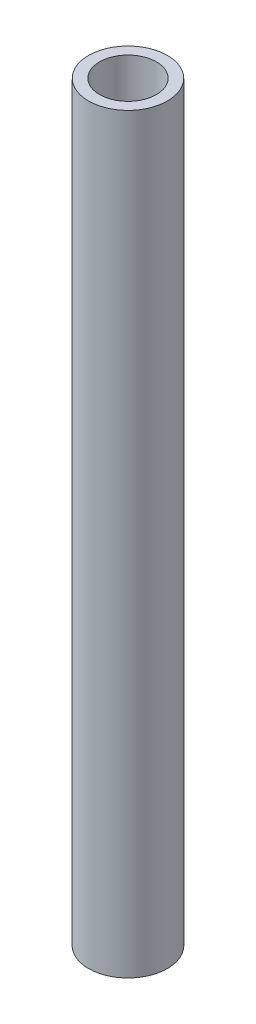
ISO-10303-21;
HEADER;
FILE_DESCRIPTION(('STEP AP214'),'2;1');
FILE_NAME('part.step','',(''),(''),'','','');
FILE_SCHEMA(('AUTOMOTIVE_DESIGN { 1 0 10303 214 1 1 1 1 }'));
ENDSEC;
DATA;
#1=APPLICATION_CONTEXT('core data for automotive mechanical design processes');
#2=APPLICATION_PROTOCOL_DEFINITION('international standard','automotive_design',2000,#1);
#3=PRODUCT_CONTEXT('',#1,'mechanical');
#4=PRODUCT('Part','Part','',(#3));
#5=PRODUCT_RELATED_PRODUCT_CATEGORY('part','',(#4));
#6=PRODUCT_DEFINITION_FORMATION('','',#4);
#7=PRODUCT_DEFINITION_CONTEXT('part definition',#1,'design');
#8=PRODUCT_DEFINITION('design','',#6,#7);
#9=PRODUCT_DEFINITION_SHAPE('','',#8);
#10=(LENGTH_UNIT() NAMED_UNIT(*) SI_UNIT(.MILLI.,.METRE.));
#11=(NAMED_UNIT(*) PLANE_ANGLE_UNIT() SI_UNIT($,.RADIAN.));
#12=(NAMED_UNIT(*) SI_UNIT($,.STERADIAN.) SOLID_ANGLE_UNIT());
#13=UNCERTAINTY_MEASURE_WITH_UNIT(LENGTH_MEASURE(1.E-05),#10,'distance_accuracy_value','');
#14=(GEOMETRIC_REPRESENTATION_CONTEXT(3) GLOBAL_UNCERTAINTY_ASSIGNED_CONTEXT((#13)) GLOBAL_UNIT_ASSIGNED_CONTEXT((#10,
#11,#12)) REPRESENTATION_CONTEXT('',''));
#15=CARTESIAN_POINT('',(0.,0.,0.));
#16=DIRECTION('',(0.,0.,1.));
#17=DIRECTION('',(1.,0.,0.));
#18=AXIS2_PLACEMENT_3D('',#15,#16,#17);
#19=CARTESIAN_POINT('',(0.,60.480702,0.));
#20=DIRECTION('',(0.,1.,0.));
#21=DIRECTION('',(0.,0.,1.));
#22=AXIS2_PLACEMENT_3D('',#19,#20,#21);
#23=PLANE('',#22);
#24=CARTESIAN_POINT('',(0.,60.480702,0.));
#25=DIRECTION('',(0.,1.,0.));
#26=DIRECTION('',(0.,0.,1.));
#27=AXIS2_PLACEMENT_3D('',#24,#25,#26);
#28=CIRCLE('',#27,3.175);
#29=CARTESIAN_POINT('',(0.,60.480702,3.175));
#30=VERTEX_POINT('',#29);
#31=EDGE_CURVE('E10',#30,#30,#28,.T.);
#32=ORIENTED_EDGE('',*,*,#31,.T.);
#33=EDGE_LOOP('',(#32));
#34=FACE_BOUND('',#33,.T.);
#35=CARTESIAN_POINT('',(0.,60.480702,0.));
#36=DIRECTION('',(0.,1.,0.));
#37=DIRECTION('',(0.,0.,1.));
#38=AXIS2_PLACEMENT_3D('',#35,#36,#37);
#39=CIRCLE('',#38,2.286);
#40=CARTESIAN_POINT('',(0.,60.480702,2.286));
#41=VERTEX_POINT('',#40);
#42=EDGE_CURVE('E42',#41,#41,#39,.T.);
#43=ORIENTED_EDGE('',*,*,#42,.F.);
#44=EDGE_LOOP('',(#43));
#45=FACE_BOUND('',#44,.T.);
#46=ADVANCED_FACE('F31',(#34,#45),#23,.T.);
#47=CARTESIAN_POINT('',(0.,0.,0.));
#48=DIRECTION('',(0.,1.,0.));
#49=DIRECTION('',(0.,0.,1.));
#50=AXIS2_PLACEMENT_3D('',#47,#48,#49);
#51=PLANE('',#50);
#52=CARTESIAN_POINT('',(0.,0.,0.));
#53=DIRECTION('',(0.,1.,0.));
#54=DIRECTION('',(0.,0.,1.));
#55=AXIS2_PLACEMENT_3D('',#52,#53,#54);
#56=CIRCLE('',#55,3.175);
#57=CARTESIAN_POINT('',(0.,0.,3.175));
#58=VERTEX_POINT('',#57);
#59=EDGE_CURVE('E35',#58,#58,#56,.T.);
#60=ORIENTED_EDGE('',*,*,#59,.F.);
#61=EDGE_LOOP('',(#60));
#62=FACE_BOUND('',#61,.T.);
#63=CARTESIAN_POINT('',(0.,0.,0.));
#64=DIRECTION('',(0.,1.,0.));
#65=DIRECTION('',(0.,0.,1.));
#66=AXIS2_PLACEMENT_3D('',#63,#64,#65);
#67=CIRCLE('',#66,2.286);
#68=CARTESIAN_POINT('',(0.,0.,2.286));
#69=VERTEX_POINT('',#68);
#70=EDGE_CURVE('E44',#69,#69,#67,.T.);
#71=ORIENTED_EDGE('',*,*,#70,.T.);
#72=EDGE_LOOP('',(#71));
#73=FACE_BOUND('',#72,.T.);
#74=ADVANCED_FACE('F54',(#62,#73),#51,.F.);
#75=CARTESIAN_POINT('',(0.,60.480702,0.));
#76=DIRECTION('',(0.,-1.,0.));
#77=DIRECTION('',(0.,0.,-1.));
#78=AXIS2_PLACEMENT_3D('',#75,#76,#77);
#79=CYLINDRICAL_SURFACE('',#78,3.175);
#80=ORIENTED_EDGE('',*,*,#31,.F.);
#81=EDGE_LOOP('',(#80));
#82=FACE_BOUND('',#81,.T.);
#83=ORIENTED_EDGE('',*,*,#59,.T.);
#84=EDGE_LOOP('',(#83));
#85=FACE_BOUND('',#84,.T.);
#86=ADVANCED_FACE('F33',(#82,#85),#79,.T.);
#87=CARTESIAN_POINT('',(0.,60.480702,0.));
#88=DIRECTION('',(0.,-1.,0.));
#89=DIRECTION('',(0.,0.,-1.));
#90=AXIS2_PLACEMENT_3D('',#87,#88,#89);
#91=CYLINDRICAL_SURFACE('',#90,2.286);
#92=ORIENTED_EDGE('',*,*,#42,.T.);
#93=EDGE_LOOP('',(#92));
#94=FACE_BOUND('',#93,.T.);
#95=ORIENTED_EDGE('',*,*,#70,.F.);
#96=EDGE_LOOP('',(#95));
#97=FACE_BOUND('',#96,.T.);
#98=ADVANCED_FACE('F50',(#94,#97),#91,.F.);
#99=CLOSED_SHELL('',(#46,#74,#86,#98));
#100=MANIFOLD_SOLID_BREP('B2',#99);
#101=ADVANCED_BREP_SHAPE_REPRESENTATION('',(#18,#100),#14);
#102=SHAPE_DEFINITION_REPRESENTATION(#9,#101);
ENDSEC;
END-ISO-10303-21;
